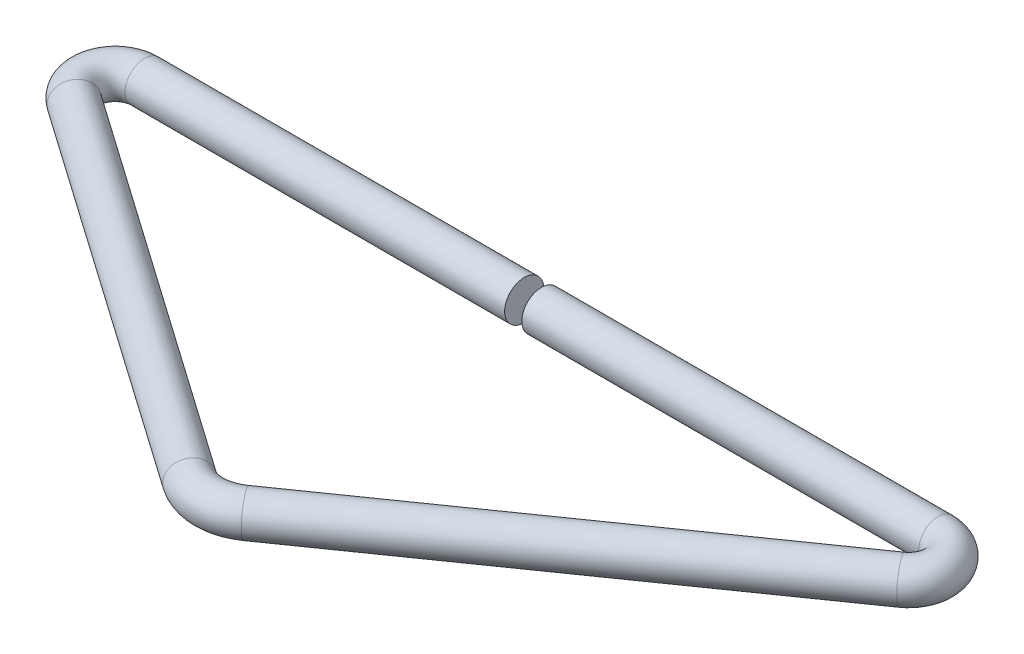
ISO-10303-21;
HEADER;
FILE_DESCRIPTION(('STEP AP214'),'2;1');
FILE_NAME('part.step','',(''),(''),'','','');
FILE_SCHEMA(('AUTOMOTIVE_DESIGN { 1 0 10303 214 1 1 1 1 }'));
ENDSEC;
DATA;
#1=APPLICATION_CONTEXT('core data for automotive mechanical design processes');
#2=APPLICATION_PROTOCOL_DEFINITION('international standard','automotive_design',2000,#1);
#3=PRODUCT_CONTEXT('',#1,'mechanical');
#4=PRODUCT('Part','Part','',(#3));
#5=PRODUCT_RELATED_PRODUCT_CATEGORY('part','',(#4));
#6=PRODUCT_DEFINITION_FORMATION('','',#4);
#7=PRODUCT_DEFINITION_CONTEXT('part definition',#1,'design');
#8=PRODUCT_DEFINITION('design','',#6,#7);
#9=PRODUCT_DEFINITION_SHAPE('','',#8);
#10=(LENGTH_UNIT() NAMED_UNIT(*) SI_UNIT(.MILLI.,.METRE.));
#11=(NAMED_UNIT(*) PLANE_ANGLE_UNIT() SI_UNIT($,.RADIAN.));
#12=(NAMED_UNIT(*) SI_UNIT($,.STERADIAN.) SOLID_ANGLE_UNIT());
#13=UNCERTAINTY_MEASURE_WITH_UNIT(LENGTH_MEASURE(1.E-05),#10,'distance_accuracy_value','');
#14=(GEOMETRIC_REPRESENTATION_CONTEXT(3) GLOBAL_UNCERTAINTY_ASSIGNED_CONTEXT((#13)) GLOBAL_UNIT_ASSIGNED_CONTEXT((#10,
#11,#12)) REPRESENTATION_CONTEXT('',''));
#15=CARTESIAN_POINT('',(0.,0.,0.));
#16=DIRECTION('',(0.,0.,1.));
#17=DIRECTION('',(1.,0.,0.));
#18=AXIS2_PLACEMENT_3D('',#15,#16,#17);
#19=CARTESIAN_POINT('',(-40.4852155929103,0.,0.));
#20=DIRECTION('',(1.,0.,0.));
#21=DIRECTION('',(0.,0.,-1.));
#22=AXIS2_PLACEMENT_3D('',#19,#20,#21);
#23=CYLINDRICAL_SURFACE('',#22,2.);
#24=CARTESIAN_POINT('',(-40.4852155929103,0.,0.));
#25=DIRECTION('',(1.,0.,0.));
#26=DIRECTION('',(0.,0.,-1.));
#27=AXIS2_PLACEMENT_3D('',#24,#25,#26);
#28=CIRCLE('',#27,2.);
#29=CARTESIAN_POINT('',(-40.4852155929103,0.,-2.));
#30=VERTEX_POINT('',#29);
#31=EDGE_CURVE('E39',#30,#30,#28,.T.);
#32=ORIENTED_EDGE('',*,*,#31,.T.);
#33=EDGE_LOOP('',(#32));
#34=FACE_BOUND('',#33,.T.);
#35=CARTESIAN_POINT('',(-1.75439268877562,0.,0.));
#36=DIRECTION('',(1.,0.,0.));
#37=DIRECTION('',(0.,0.,-1.));
#38=AXIS2_PLACEMENT_3D('',#35,#36,#37);
#39=CIRCLE('',#38,2.);
#40=CARTESIAN_POINT('',(-1.75439268877563,0.,-2.00000000000001));
#41=VERTEX_POINT('',#40);
#42=EDGE_CURVE('E10',#41,#41,#39,.T.);
#43=ORIENTED_EDGE('',*,*,#42,.F.);
#44=EDGE_LOOP('',(#43));
#45=FACE_BOUND('',#44,.T.);
#46=ADVANCED_FACE('F33',(#34,#45),#23,.T.);
#47=CARTESIAN_POINT('',(-40.4852155929103,0.,3.));
#48=DIRECTION('',(0.,-1.,0.));
#49=DIRECTION('',(0.,0.,-1.));
#50=AXIS2_PLACEMENT_3D('',#47,#48,#49);
#51=TOROIDAL_SURFACE('',#50,3.,2.);
#52=CARTESIAN_POINT('',(-42.2059449019634,0.,5.45745613286699));
#53=DIRECTION('',(-0.819152044288997,0.,-0.573576436351039));
#54=DIRECTION('',(-0.573576436351039,0.,0.819152044288997));
#55=AXIS2_PLACEMENT_3D('',#52,#53,#54);
#56=CIRCLE('',#55,2.);
#57=CARTESIAN_POINT('',(-43.3530977746655,0.,7.09576022144498));
#58=VERTEX_POINT('',#57);
#59=EDGE_CURVE('E43',#58,#58,#56,.T.);
#60=CARTESIAN_POINT('',(-40.4852155929103,0.,3.));
#61=DIRECTION('',(0.,-1.,0.));
#62=DIRECTION('',(0.,0.,-1.));
#63=AXIS2_PLACEMENT_3D('',#60,#61,#62);
#64=CIRCLE('',#63,5.);
#65=EDGE_CURVE('',#58,#30,#64,.T.);
#66=ORIENTED_EDGE('',*,*,#59,.T.);
#67=ORIENTED_EDGE('',*,*,#31,.F.);
#68=ORIENTED_EDGE('',*,*,#65,.T.);
#69=ORIENTED_EDGE('',*,*,#65,.F.);
#70=EDGE_LOOP('',(#66,#68,#67,#69));
#71=FACE_BOUND('',#70,.T.);
#72=ADVANCED_FACE('F83',(#71),#51,.T.);
#73=CARTESIAN_POINT('',(-2.8678821817552,0.,33.0022641881228));
#74=DIRECTION('',(-0.819152044288995,0.,-0.573576436351041));
#75=DIRECTION('',(-0.573576436351041,0.,0.819152044288995));
#76=AXIS2_PLACEMENT_3D('',#73,#74,#75);
#77=CYLINDRICAL_SURFACE('',#76,2.);
#78=CARTESIAN_POINT('',(-2.8678821817552,0.,33.0022641881228));
#79=DIRECTION('',(-0.819152044288997,0.,-0.573576436351039));
#80=DIRECTION('',(-0.573576436351039,0.,0.819152044288997));
#81=AXIS2_PLACEMENT_3D('',#78,#79,#80);
#82=CIRCLE('',#81,2.);
#83=CARTESIAN_POINT('',(-4.01503505445728,0.,34.6405682767008));
#84=VERTEX_POINT('',#83);
#85=EDGE_CURVE('E47',#84,#84,#82,.T.);
#86=ORIENTED_EDGE('',*,*,#85,.T.);
#87=EDGE_LOOP('',(#86));
#88=FACE_BOUND('',#87,.T.);
#89=ORIENTED_EDGE('',*,*,#59,.F.);
#90=EDGE_LOOP('',(#89));
#91=FACE_BOUND('',#90,.T.);
#92=ADVANCED_FACE('F87',(#88,#91),#77,.T.);
#93=CARTESIAN_POINT('',(0.,0.,28.9065039666778));
#94=DIRECTION('',(0.,-1.,0.));
#95=DIRECTION('',(0.,0.,-1.));
#96=AXIS2_PLACEMENT_3D('',#93,#94,#95);
#97=TOROIDAL_SURFACE('',#96,5.,2.);
#98=CARTESIAN_POINT('',(2.86788218175521,0.,33.0022641881228));
#99=DIRECTION('',(-0.819152044288994,0.,0.573576436351042));
#100=DIRECTION('',(0.573576436351042,0.,0.819152044288994));
#101=AXIS2_PLACEMENT_3D('',#98,#99,#100);
#102=CIRCLE('',#101,2.);
#103=CARTESIAN_POINT('',(4.01503505445729,0.,34.6405682767008));
#104=VERTEX_POINT('',#103);
#105=EDGE_CURVE('E52',#104,#104,#102,.T.);
#106=CARTESIAN_POINT('',(0.,0.,28.9065039666778));
#107=DIRECTION('',(0.,-1.,0.));
#108=DIRECTION('',(0.,0.,-1.));
#109=AXIS2_PLACEMENT_3D('',#106,#107,#108);
#110=CIRCLE('',#109,7.);
#111=EDGE_CURVE('',#104,#84,#110,.T.);
#112=ORIENTED_EDGE('',*,*,#105,.T.);
#113=ORIENTED_EDGE('',*,*,#85,.F.);
#114=ORIENTED_EDGE('',*,*,#111,.T.);
#115=ORIENTED_EDGE('',*,*,#111,.F.);
#116=EDGE_LOOP('',(#112,#114,#113,#115));
#117=FACE_BOUND('',#116,.T.);
#118=ADVANCED_FACE('F93',(#117),#97,.T.);
#119=CARTESIAN_POINT('',(42.2059449019634,0.,5.45745613286698));
#120=DIRECTION('',(-0.819152044288995,0.,0.573576436351042));
#121=DIRECTION('',(0.573576436351042,0.,0.819152044288995));
#122=AXIS2_PLACEMENT_3D('',#119,#120,#121);
#123=CYLINDRICAL_SURFACE('',#122,2.);
#124=CARTESIAN_POINT('',(42.2059449019634,0.,5.45745613286698));
#125=DIRECTION('',(-0.819152044288994,0.,0.573576436351042));
#126=DIRECTION('',(0.573576436351042,0.,0.819152044288994));
#127=AXIS2_PLACEMENT_3D('',#124,#125,#126);
#128=CIRCLE('',#127,2.);
#129=CARTESIAN_POINT('',(43.3530977746655,0.,7.09576022144497));
#130=VERTEX_POINT('',#129);
#131=EDGE_CURVE('E55',#130,#130,#128,.T.);
#132=ORIENTED_EDGE('',*,*,#131,.T.);
#133=EDGE_LOOP('',(#132));
#134=FACE_BOUND('',#133,.T.);
#135=ORIENTED_EDGE('',*,*,#105,.F.);
#136=EDGE_LOOP('',(#135));
#137=FACE_BOUND('',#136,.T.);
#138=ADVANCED_FACE('F100',(#134,#137),#123,.T.);
#139=CARTESIAN_POINT('',(40.4852155929103,0.,3.));
#140=DIRECTION('',(0.,-1.,0.));
#141=DIRECTION('',(0.,0.,-1.));
#142=AXIS2_PLACEMENT_3D('',#139,#140,#141);
#143=TOROIDAL_SURFACE('',#142,3.,2.);
#144=CARTESIAN_POINT('',(40.4852155929103,0.,0.));
#145=DIRECTION('',(1.,0.,0.));
#146=DIRECTION('',(0.,0.,-1.));
#147=AXIS2_PLACEMENT_3D('',#144,#145,#146);
#148=CIRCLE('',#147,2.);
#149=CARTESIAN_POINT('',(40.4852155929103,0.,-2.));
#150=VERTEX_POINT('',#149);
#151=EDGE_CURVE('E58',#150,#150,#148,.T.);
#152=CARTESIAN_POINT('',(40.4852155929103,0.,3.));
#153=DIRECTION('',(0.,-1.,0.));
#154=DIRECTION('',(0.,0.,-1.));
#155=AXIS2_PLACEMENT_3D('',#152,#153,#154);
#156=CIRCLE('',#155,5.);
#157=EDGE_CURVE('',#150,#130,#156,.T.);
#158=ORIENTED_EDGE('',*,*,#151,.T.);
#159=ORIENTED_EDGE('',*,*,#131,.F.);
#160=ORIENTED_EDGE('',*,*,#157,.T.);
#161=ORIENTED_EDGE('',*,*,#157,.F.);
#162=EDGE_LOOP('',(#158,#160,#159,#161));
#163=FACE_BOUND('',#162,.T.);
#164=ADVANCED_FACE('F65',(#163),#143,.T.);
#165=CARTESIAN_POINT('',(40.4852155929103,0.,0.));
#166=DIRECTION('',(-1.,0.,0.));
#167=DIRECTION('',(0.,0.,1.));
#168=AXIS2_PLACEMENT_3D('',#165,#166,#167);
#169=CYLINDRICAL_SURFACE('',#168,2.);
#170=ORIENTED_EDGE('',*,*,#151,.F.);
#171=EDGE_LOOP('',(#170));
#172=FACE_BOUND('',#171,.T.);
#173=CARTESIAN_POINT('',(0.,0.,0.));
#174=DIRECTION('',(1.,0.,0.));
#175=DIRECTION('',(0.,0.,-1.));
#176=AXIS2_PLACEMENT_3D('',#173,#174,#175);
#177=CIRCLE('',#176,2.);
#178=CARTESIAN_POINT('',(0.,0.,-2.));
#179=VERTEX_POINT('',#178);
#180=EDGE_CURVE('E59',#179,#179,#177,.T.);
#181=ORIENTED_EDGE('',*,*,#180,.T.);
#182=EDGE_LOOP('',(#181));
#183=FACE_BOUND('',#182,.T.);
#184=ADVANCED_FACE('F68',(#172,#183),#169,.T.);
#185=CARTESIAN_POINT('',(-1.75439268877562,0.,0.));
#186=DIRECTION('',(1.,0.,0.));
#187=DIRECTION('',(0.,0.,-1.));
#188=AXIS2_PLACEMENT_3D('',#185,#186,#187);
#189=PLANE('',#188);
#190=ORIENTED_EDGE('',*,*,#42,.T.);
#191=EDGE_LOOP('',(#190));
#192=FACE_BOUND('',#191,.T.);
#193=ADVANCED_FACE('F71',(#192),#189,.T.);
#194=CARTESIAN_POINT('',(0.,0.,0.));
#195=DIRECTION('',(1.,0.,0.));
#196=DIRECTION('',(0.,0.,-1.));
#197=AXIS2_PLACEMENT_3D('',#194,#195,#196);
#198=PLANE('',#197);
#199=ORIENTED_EDGE('',*,*,#180,.F.);
#200=EDGE_LOOP('',(#199));
#201=FACE_BOUND('',#200,.T.);
#202=ADVANCED_FACE('F75',(#201),#198,.F.);
#203=CLOSED_SHELL('',(#46,#72,#92,#118,#138,#164,#184,#193,#202));
#204=MANIFOLD_SOLID_BREP('B2',#203);
#205=ADVANCED_BREP_SHAPE_REPRESENTATION('',(#18,#204),#14);
#206=SHAPE_DEFINITION_REPRESENTATION(#9,#205);
ENDSEC;
END-ISO-10303-21;
